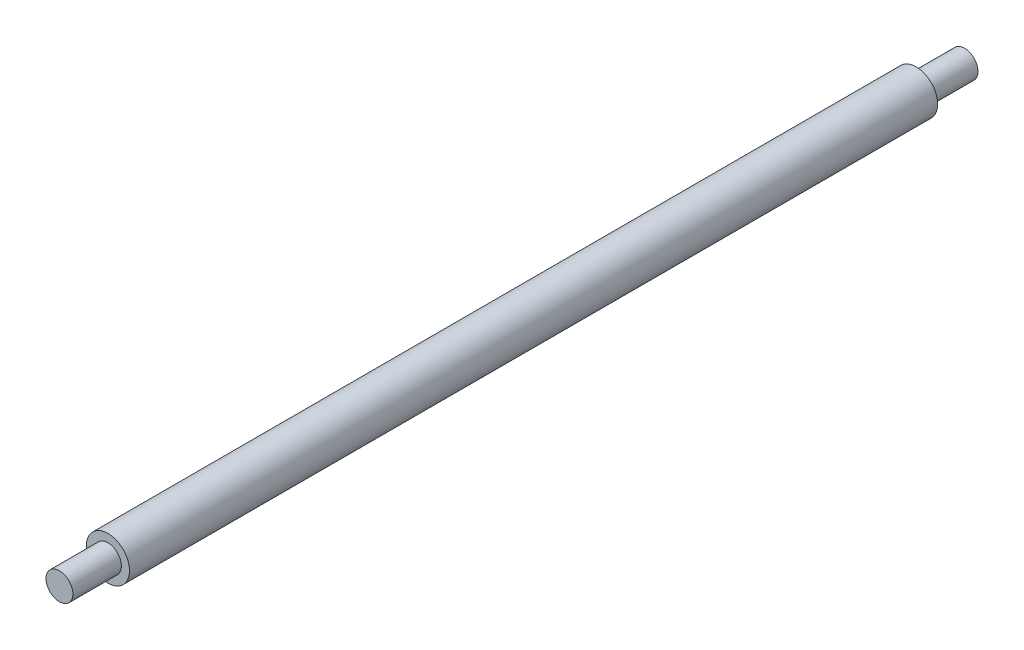
ISO-10303-21;
HEADER;
FILE_DESCRIPTION(('STEP AP214'),'2;1');
FILE_NAME('part.step','',(''),(''),'','','');
FILE_SCHEMA(('AUTOMOTIVE_DESIGN { 1 0 10303 214 1 1 1 1 }'));
ENDSEC;
DATA;
#1=APPLICATION_CONTEXT('core data for automotive mechanical design processes');
#2=APPLICATION_PROTOCOL_DEFINITION('international standard','automotive_design',2000,#1);
#3=PRODUCT_CONTEXT('',#1,'mechanical');
#4=PRODUCT('Part','Part','',(#3));
#5=PRODUCT_RELATED_PRODUCT_CATEGORY('part','',(#4));
#6=PRODUCT_DEFINITION_FORMATION('','',#4);
#7=PRODUCT_DEFINITION_CONTEXT('part definition',#1,'design');
#8=PRODUCT_DEFINITION('design','',#6,#7);
#9=PRODUCT_DEFINITION_SHAPE('','',#8);
#10=(LENGTH_UNIT() NAMED_UNIT(*) SI_UNIT(.MILLI.,.METRE.));
#11=(NAMED_UNIT(*) PLANE_ANGLE_UNIT() SI_UNIT($,.RADIAN.));
#12=(NAMED_UNIT(*) SI_UNIT($,.STERADIAN.) SOLID_ANGLE_UNIT());
#13=UNCERTAINTY_MEASURE_WITH_UNIT(LENGTH_MEASURE(1.E-05),#10,'distance_accuracy_value','');
#14=(GEOMETRIC_REPRESENTATION_CONTEXT(3) GLOBAL_UNCERTAINTY_ASSIGNED_CONTEXT((#13)) GLOBAL_UNIT_ASSIGNED_CONTEXT((#10,
#11,#12)) REPRESENTATION_CONTEXT('',''));
#15=CARTESIAN_POINT('',(0.,0.,0.));
#16=DIRECTION('',(0.,0.,1.));
#17=DIRECTION('',(1.,0.,0.));
#18=AXIS2_PLACEMENT_3D('',#15,#16,#17);
#19=CARTESIAN_POINT('',(0.,0.,750.));
#20=DIRECTION('',(0.,0.,-1.));
#21=DIRECTION('',(-1.,0.,0.));
#22=AXIS2_PLACEMENT_3D('',#19,#20,#21);
#23=CYLINDRICAL_SURFACE('',#22,20.);
#24=CARTESIAN_POINT('',(0.,0.,750.));
#25=DIRECTION('',(0.,0.,1.));
#26=DIRECTION('',(1.,0.,0.));
#27=AXIS2_PLACEMENT_3D('',#24,#25,#26);
#28=CIRCLE('',#27,20.);
#29=CARTESIAN_POINT('',(20.,0.,750.));
#30=VERTEX_POINT('',#29);
#31=EDGE_CURVE('E51',#30,#30,#28,.T.);
#32=ORIENTED_EDGE('',*,*,#31,.F.);
#33=EDGE_LOOP('',(#32));
#34=FACE_BOUND('',#33,.T.);
#35=CARTESIAN_POINT('',(0.,0.,0.));
#36=DIRECTION('',(0.,0.,1.));
#37=DIRECTION('',(1.,0.,0.));
#38=AXIS2_PLACEMENT_3D('',#35,#36,#37);
#39=CIRCLE('',#38,20.);
#40=CARTESIAN_POINT('',(20.,0.,0.));
#41=VERTEX_POINT('',#40);
#42=EDGE_CURVE('E40',#41,#41,#39,.T.);
#43=ORIENTED_EDGE('',*,*,#42,.T.);
#44=EDGE_LOOP('',(#43));
#45=FACE_BOUND('',#44,.T.);
#46=ADVANCED_FACE('F37',(#34,#45),#23,.T.);
#47=CARTESIAN_POINT('',(0.,0.,750.));
#48=DIRECTION('',(0.,0.,1.));
#49=DIRECTION('',(1.,0.,0.));
#50=AXIS2_PLACEMENT_3D('',#47,#48,#49);
#51=PLANE('',#50);
#52=CARTESIAN_POINT('',(0.,0.,750.));
#53=DIRECTION('',(0.,0.,1.));
#54=DIRECTION('',(1.,0.,0.));
#55=AXIS2_PLACEMENT_3D('',#52,#53,#54);
#56=CIRCLE('',#55,12.5);
#57=CARTESIAN_POINT('',(12.5,0.,750.));
#58=VERTEX_POINT('',#57);
#59=EDGE_CURVE('E45',#58,#58,#56,.T.);
#60=ORIENTED_EDGE('',*,*,#59,.F.);
#61=EDGE_LOOP('',(#60));
#62=FACE_BOUND('',#61,.T.);
#63=ORIENTED_EDGE('',*,*,#31,.T.);
#64=EDGE_LOOP('',(#63));
#65=FACE_BOUND('',#64,.T.);
#66=ADVANCED_FACE('F71',(#62,#65),#51,.T.);
#67=CARTESIAN_POINT('',(0.,0.,0.));
#68=DIRECTION('',(0.,0.,1.));
#69=DIRECTION('',(1.,0.,0.));
#70=AXIS2_PLACEMENT_3D('',#67,#68,#69);
#71=PLANE('',#70);
#72=CARTESIAN_POINT('',(0.,0.,0.));
#73=DIRECTION('',(0.,0.,-1.));
#74=DIRECTION('',(-1.,0.,0.));
#75=AXIS2_PLACEMENT_3D('',#72,#73,#74);
#76=CIRCLE('',#75,12.5);
#77=CARTESIAN_POINT('',(-12.5,0.,0.));
#78=VERTEX_POINT('',#77);
#79=EDGE_CURVE('E10',#78,#78,#76,.T.);
#80=ORIENTED_EDGE('',*,*,#79,.F.);
#81=EDGE_LOOP('',(#80));
#82=FACE_BOUND('',#81,.T.);
#83=ORIENTED_EDGE('',*,*,#42,.F.);
#84=EDGE_LOOP('',(#83));
#85=FACE_BOUND('',#84,.T.);
#86=ADVANCED_FACE('F68',(#82,#85),#71,.F.);
#87=CARTESIAN_POINT('',(0.,0.,795.));
#88=DIRECTION('',(0.,0.,-1.));
#89=DIRECTION('',(-1.,0.,0.));
#90=AXIS2_PLACEMENT_3D('',#87,#88,#89);
#91=CYLINDRICAL_SURFACE('',#90,12.5);
#92=CARTESIAN_POINT('',(0.,0.,795.));
#93=DIRECTION('',(0.,0.,1.));
#94=DIRECTION('',(1.,0.,0.));
#95=AXIS2_PLACEMENT_3D('',#92,#93,#94);
#96=CIRCLE('',#95,12.5);
#97=CARTESIAN_POINT('',(12.5,0.,795.));
#98=VERTEX_POINT('',#97);
#99=EDGE_CURVE('E56',#98,#98,#96,.T.);
#100=ORIENTED_EDGE('',*,*,#99,.F.);
#101=EDGE_LOOP('',(#100));
#102=FACE_BOUND('',#101,.T.);
#103=ORIENTED_EDGE('',*,*,#59,.T.);
#104=EDGE_LOOP('',(#103));
#105=FACE_BOUND('',#104,.T.);
#106=ADVANCED_FACE('F70',(#102,#105),#91,.T.);
#107=CARTESIAN_POINT('',(0.,0.,795.));
#108=DIRECTION('',(0.,0.,1.));
#109=DIRECTION('',(1.,0.,0.));
#110=AXIS2_PLACEMENT_3D('',#107,#108,#109);
#111=PLANE('',#110);
#112=ORIENTED_EDGE('',*,*,#99,.T.);
#113=EDGE_LOOP('',(#112));
#114=FACE_BOUND('',#113,.T.);
#115=ADVANCED_FACE('F77',(#114),#111,.T.);
#116=CARTESIAN_POINT('',(0.,0.,-45.));
#117=DIRECTION('',(0.,0.,1.));
#118=DIRECTION('',(1.,0.,0.));
#119=AXIS2_PLACEMENT_3D('',#116,#117,#118);
#120=CYLINDRICAL_SURFACE('',#119,12.5);
#121=CARTESIAN_POINT('',(0.,0.,-45.));
#122=DIRECTION('',(0.,0.,-1.));
#123=DIRECTION('',(-1.,0.,0.));
#124=AXIS2_PLACEMENT_3D('',#121,#122,#123);
#125=CIRCLE('',#124,12.5);
#126=CARTESIAN_POINT('',(-12.5,0.,-45.));
#127=VERTEX_POINT('',#126);
#128=EDGE_CURVE('E55',#127,#127,#125,.T.);
#129=ORIENTED_EDGE('',*,*,#128,.F.);
#130=EDGE_LOOP('',(#129));
#131=FACE_BOUND('',#130,.T.);
#132=ORIENTED_EDGE('',*,*,#79,.T.);
#133=EDGE_LOOP('',(#132));
#134=FACE_BOUND('',#133,.T.);
#135=ADVANCED_FACE('F105',(#131,#134),#120,.T.);
#136=CARTESIAN_POINT('',(0.,0.,-45.));
#137=DIRECTION('',(0.,0.,-1.));
#138=DIRECTION('',(-1.,0.,0.));
#139=AXIS2_PLACEMENT_3D('',#136,#137,#138);
#140=PLANE('',#139);
#141=ORIENTED_EDGE('',*,*,#128,.T.);
#142=EDGE_LOOP('',(#141));
#143=FACE_BOUND('',#142,.T.);
#144=ADVANCED_FACE('F119',(#143),#140,.T.);
#145=CLOSED_SHELL('',(#46,#66,#86,#106,#115,#135,#144));
#146=MANIFOLD_SOLID_BREP('B2',#145);
#147=ADVANCED_BREP_SHAPE_REPRESENTATION('',(#18,#146),#14);
#148=SHAPE_DEFINITION_REPRESENTATION(#9,#147);
ENDSEC;
END-ISO-10303-21;
